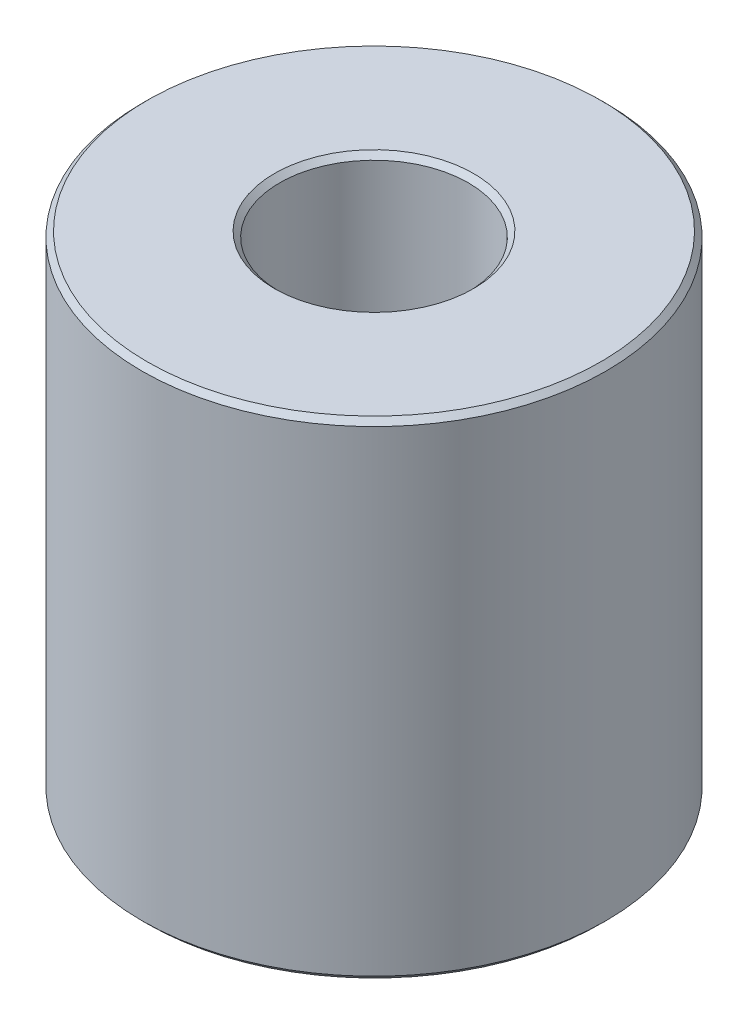
ISO-10303-21;
HEADER;
FILE_DESCRIPTION(('STEP AP214'),'2;1');
FILE_NAME('part.step','',(''),(''),'','','');
FILE_SCHEMA(('AUTOMOTIVE_DESIGN { 1 0 10303 214 1 1 1 1 }'));
ENDSEC;
DATA;
#1=APPLICATION_CONTEXT('core data for automotive mechanical design processes');
#2=APPLICATION_PROTOCOL_DEFINITION('international standard','automotive_design',2000,#1);
#3=PRODUCT_CONTEXT('',#1,'mechanical');
#4=PRODUCT('Part','Part','',(#3));
#5=PRODUCT_RELATED_PRODUCT_CATEGORY('part','',(#4));
#6=PRODUCT_DEFINITION_FORMATION('','',#4);
#7=PRODUCT_DEFINITION_CONTEXT('part definition',#1,'design');
#8=PRODUCT_DEFINITION('design','',#6,#7);
#9=PRODUCT_DEFINITION_SHAPE('','',#8);
#10=(LENGTH_UNIT() NAMED_UNIT(*) SI_UNIT(.MILLI.,.METRE.));
#11=(NAMED_UNIT(*) PLANE_ANGLE_UNIT() SI_UNIT($,.RADIAN.));
#12=(NAMED_UNIT(*) SI_UNIT($,.STERADIAN.) SOLID_ANGLE_UNIT());
#13=UNCERTAINTY_MEASURE_WITH_UNIT(LENGTH_MEASURE(1.E-05),#10,'distance_accuracy_value','');
#14=(GEOMETRIC_REPRESENTATION_CONTEXT(3) GLOBAL_UNCERTAINTY_ASSIGNED_CONTEXT((#13)) GLOBAL_UNIT_ASSIGNED_CONTEXT((#10,
#11,#12)) REPRESENTATION_CONTEXT('',''));
#15=CARTESIAN_POINT('',(0.,0.,0.));
#16=DIRECTION('',(0.,0.,1.));
#17=DIRECTION('',(1.,0.,0.));
#18=AXIS2_PLACEMENT_3D('',#15,#16,#17);
#19=CARTESIAN_POINT('',(0.,115.384661434594,0.));
#20=DIRECTION('',(0.,-1.,0.));
#21=DIRECTION('',(0.,0.,-1.));
#22=AXIS2_PLACEMENT_3D('',#19,#20,#21);
#23=CYLINDRICAL_SURFACE('',#22,55.);
#24=CARTESIAN_POINT('',(0.,1.26716721925978,0.));
#25=DIRECTION('',(0.,1.,0.));
#26=DIRECTION('',(0.,0.,1.));
#27=AXIS2_PLACEMENT_3D('',#24,#25,#26);
#28=CIRCLE('',#27,55.);
#29=CARTESIAN_POINT('',(0.,1.26716721925978,55.));
#30=VERTEX_POINT('',#29);
#31=EDGE_CURVE('E10',#30,#30,#28,.T.);
#32=ORIENTED_EDGE('',*,*,#31,.T.);
#33=EDGE_LOOP('',(#32));
#34=FACE_BOUND('',#33,.T.);
#35=CARTESIAN_POINT('',(0.,114.117494215334,0.));
#36=DIRECTION('',(0.,1.,0.));
#37=DIRECTION('',(0.,0.,1.));
#38=AXIS2_PLACEMENT_3D('',#35,#36,#37);
#39=CIRCLE('',#38,55.);
#40=CARTESIAN_POINT('',(0.,114.117494215334,55.));
#41=VERTEX_POINT('',#40);
#42=EDGE_CURVE('E50',#41,#41,#39,.F.);
#43=ORIENTED_EDGE('',*,*,#42,.T.);
#44=EDGE_LOOP('',(#43));
#45=FACE_BOUND('',#44,.T.);
#46=ADVANCED_FACE('F39',(#34,#45),#23,.T.);
#47=CARTESIAN_POINT('',(0.,115.384661434594,0.));
#48=DIRECTION('',(0.,1.,0.));
#49=DIRECTION('',(0.,0.,1.));
#50=AXIS2_PLACEMENT_3D('',#47,#48,#49);
#51=PLANE('',#50);
#52=CARTESIAN_POINT('',(0.,115.384661434594,0.));
#53=DIRECTION('',(0.,1.,0.));
#54=DIRECTION('',(0.,0.,1.));
#55=AXIS2_PLACEMENT_3D('',#52,#53,#54);
#56=CIRCLE('',#55,23.631667397817);
#57=CARTESIAN_POINT('',(0.,115.384661434594,23.631667397817));
#58=VERTEX_POINT('',#57);
#59=EDGE_CURVE('E58',#58,#58,#56,.F.);
#60=ORIENTED_EDGE('',*,*,#59,.T.);
#61=EDGE_LOOP('',(#60));
#62=FACE_BOUND('',#61,.T.);
#63=CARTESIAN_POINT('',(0.,115.384661434594,0.));
#64=DIRECTION('',(0.,1.,0.));
#65=DIRECTION('',(0.,0.,1.));
#66=AXIS2_PLACEMENT_3D('',#63,#64,#65);
#67=CIRCLE('',#66,53.7328327807402);
#68=CARTESIAN_POINT('',(0.,115.384661434594,53.7328327807402));
#69=VERTEX_POINT('',#68);
#70=EDGE_CURVE('E61',#69,#69,#67,.T.);
#71=ORIENTED_EDGE('',*,*,#70,.T.);
#72=EDGE_LOOP('',(#71));
#73=FACE_BOUND('',#72,.T.);
#74=ADVANCED_FACE('F88',(#62,#73),#51,.T.);
#75=CARTESIAN_POINT('',(0.,0.,0.));
#76=DIRECTION('',(0.,1.,0.));
#77=DIRECTION('',(0.,0.,1.));
#78=AXIS2_PLACEMENT_3D('',#75,#76,#77);
#79=PLANE('',#78);
#80=CARTESIAN_POINT('',(0.,0.,0.));
#81=DIRECTION('',(0.,1.,0.));
#82=DIRECTION('',(0.,0.,1.));
#83=AXIS2_PLACEMENT_3D('',#80,#81,#82);
#84=CIRCLE('',#83,23.631667397817);
#85=CARTESIAN_POINT('',(0.,0.,23.631667397817));
#86=VERTEX_POINT('',#85);
#87=EDGE_CURVE('E51',#86,#86,#84,.T.);
#88=ORIENTED_EDGE('',*,*,#87,.T.);
#89=EDGE_LOOP('',(#88));
#90=FACE_BOUND('',#89,.T.);
#91=CARTESIAN_POINT('',(0.,0.,0.));
#92=DIRECTION('',(0.,1.,0.));
#93=DIRECTION('',(0.,0.,1.));
#94=AXIS2_PLACEMENT_3D('',#91,#92,#93);
#95=CIRCLE('',#94,53.7328327807402);
#96=CARTESIAN_POINT('',(0.,0.,53.7328327807402));
#97=VERTEX_POINT('',#96);
#98=EDGE_CURVE('E54',#97,#97,#95,.F.);
#99=ORIENTED_EDGE('',*,*,#98,.T.);
#100=EDGE_LOOP('',(#99));
#101=FACE_BOUND('',#100,.T.);
#102=ADVANCED_FACE('F83',(#90,#101),#79,.F.);
#103=CARTESIAN_POINT('',(0.,115.384661434594,0.));
#104=DIRECTION('',(0.,-1.,0.));
#105=DIRECTION('',(0.,0.,-1.));
#106=AXIS2_PLACEMENT_3D('',#103,#104,#105);
#107=CYLINDRICAL_SURFACE('',#106,22.3645001785572);
#108=CARTESIAN_POINT('',(0.,114.117494215334,0.));
#109=DIRECTION('',(0.,1.,0.));
#110=DIRECTION('',(0.,0.,1.));
#111=AXIS2_PLACEMENT_3D('',#108,#109,#110);
#112=CIRCLE('',#111,22.3645001785572);
#113=CARTESIAN_POINT('',(0.,114.117494215334,22.3645001785572));
#114=VERTEX_POINT('',#113);
#115=EDGE_CURVE('E67',#114,#114,#112,.T.);
#116=ORIENTED_EDGE('',*,*,#115,.T.);
#117=EDGE_LOOP('',(#116));
#118=FACE_BOUND('',#117,.T.);
#119=CARTESIAN_POINT('',(0.,1.26716721925982,0.));
#120=DIRECTION('',(0.,1.,0.));
#121=DIRECTION('',(0.,0.,1.));
#122=AXIS2_PLACEMENT_3D('',#119,#120,#121);
#123=CIRCLE('',#122,22.3645001785572);
#124=CARTESIAN_POINT('',(0.,1.26716721925982,22.3645001785572));
#125=VERTEX_POINT('',#124);
#126=EDGE_CURVE('E69',#125,#125,#123,.F.);
#127=ORIENTED_EDGE('',*,*,#126,.T.);
#128=EDGE_LOOP('',(#127));
#129=FACE_BOUND('',#128,.T.);
#130=ADVANCED_FACE('F71',(#118,#129),#107,.F.);
#131=CARTESIAN_POINT('',(0.,114.117494215334,0.));
#132=DIRECTION('',(0.,1.,0.));
#133=DIRECTION('',(0.,0.,1.));
#134=AXIS2_PLACEMENT_3D('',#131,#132,#133);
#135=CONICAL_SURFACE('',#134,22.3645001785572,0.785398163397448);
#136=ORIENTED_EDGE('',*,*,#59,.F.);
#137=EDGE_LOOP('',(#136));
#138=FACE_BOUND('',#137,.T.);
#139=ORIENTED_EDGE('',*,*,#115,.F.);
#140=EDGE_LOOP('',(#139));
#141=FACE_BOUND('',#140,.T.);
#142=ADVANCED_FACE('F77',(#138,#141),#135,.F.);
#143=CARTESIAN_POINT('',(0.,0.,0.));
#144=DIRECTION('',(0.,-1.,0.));
#145=DIRECTION('',(0.,0.,-1.));
#146=AXIS2_PLACEMENT_3D('',#143,#144,#145);
#147=CONICAL_SURFACE('',#146,23.631667397817,0.785398163397451);
#148=ORIENTED_EDGE('',*,*,#126,.F.);
#149=EDGE_LOOP('',(#148));
#150=FACE_BOUND('',#149,.T.);
#151=ORIENTED_EDGE('',*,*,#87,.F.);
#152=EDGE_LOOP('',(#151));
#153=FACE_BOUND('',#152,.T.);
#154=ADVANCED_FACE('F73',(#150,#153),#147,.F.);
#155=CARTESIAN_POINT('',(0.,1.26716721925978,0.));
#156=DIRECTION('',(0.,1.,0.));
#157=DIRECTION('',(0.,0.,1.));
#158=AXIS2_PLACEMENT_3D('',#155,#156,#157);
#159=CONICAL_SURFACE('',#158,55.,0.785398163397451);
#160=ORIENTED_EDGE('',*,*,#98,.F.);
#161=EDGE_LOOP('',(#160));
#162=FACE_BOUND('',#161,.T.);
#163=ORIENTED_EDGE('',*,*,#31,.F.);
#164=EDGE_LOOP('',(#163));
#165=FACE_BOUND('',#164,.T.);
#166=ADVANCED_FACE('F76',(#162,#165),#159,.T.);
#167=CARTESIAN_POINT('',(0.,115.384661434594,0.));
#168=DIRECTION('',(0.,-1.,0.));
#169=DIRECTION('',(0.,0.,-1.));
#170=AXIS2_PLACEMENT_3D('',#167,#168,#169);
#171=CONICAL_SURFACE('',#170,53.7328327807402,0.785398163397451);
#172=ORIENTED_EDGE('',*,*,#42,.F.);
#173=EDGE_LOOP('',(#172));
#174=FACE_BOUND('',#173,.T.);
#175=ORIENTED_EDGE('',*,*,#70,.F.);
#176=EDGE_LOOP('',(#175));
#177=FACE_BOUND('',#176,.T.);
#178=ADVANCED_FACE('F45',(#174,#177),#171,.T.);
#179=CLOSED_SHELL('',(#46,#74,#102,#130,#142,#154,#166,#178));
#180=MANIFOLD_SOLID_BREP('B2',#179);
#181=ADVANCED_BREP_SHAPE_REPRESENTATION('',(#18,#180),#14);
#182=SHAPE_DEFINITION_REPRESENTATION(#9,#181);
ENDSEC;
END-ISO-10303-21;
